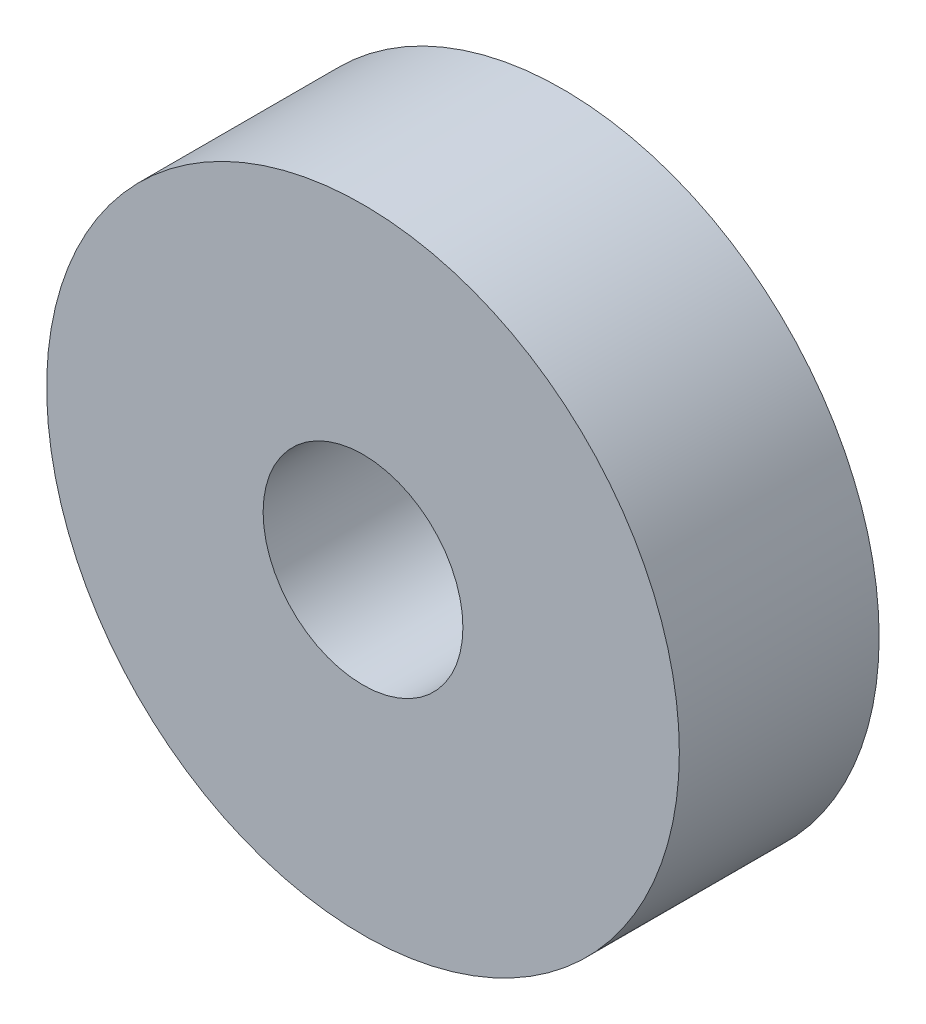
ISO-10303-21;
HEADER;
FILE_DESCRIPTION(('STEP AP214'),'2;1');
FILE_NAME('part.step','',(''),(''),'','','');
FILE_SCHEMA(('AUTOMOTIVE_DESIGN { 1 0 10303 214 1 1 1 1 }'));
ENDSEC;
DATA;
#1=APPLICATION_CONTEXT('core data for automotive mechanical design processes');
#2=APPLICATION_PROTOCOL_DEFINITION('international standard','automotive_design',2000,#1);
#3=PRODUCT_CONTEXT('',#1,'mechanical');
#4=PRODUCT('Part','Part','',(#3));
#5=PRODUCT_RELATED_PRODUCT_CATEGORY('part','',(#4));
#6=PRODUCT_DEFINITION_FORMATION('','',#4);
#7=PRODUCT_DEFINITION_CONTEXT('part definition',#1,'design');
#8=PRODUCT_DEFINITION('design','',#6,#7);
#9=PRODUCT_DEFINITION_SHAPE('','',#8);
#10=(LENGTH_UNIT() NAMED_UNIT(*) SI_UNIT(.MILLI.,.METRE.));
#11=(NAMED_UNIT(*) PLANE_ANGLE_UNIT() SI_UNIT($,.RADIAN.));
#12=(NAMED_UNIT(*) SI_UNIT($,.STERADIAN.) SOLID_ANGLE_UNIT());
#13=UNCERTAINTY_MEASURE_WITH_UNIT(LENGTH_MEASURE(1.E-05),#10,'distance_accuracy_value','');
#14=(GEOMETRIC_REPRESENTATION_CONTEXT(3) GLOBAL_UNCERTAINTY_ASSIGNED_CONTEXT((#13)) GLOBAL_UNIT_ASSIGNED_CONTEXT((#10,
#11,#12)) REPRESENTATION_CONTEXT('',''));
#15=CARTESIAN_POINT('',(0.,0.,0.));
#16=DIRECTION('',(0.,0.,1.));
#17=DIRECTION('',(1.,0.,0.));
#18=AXIS2_PLACEMENT_3D('',#15,#16,#17);
#19=CARTESIAN_POINT('',(0.,0.,6.));
#20=DIRECTION('',(0.,0.,1.));
#21=DIRECTION('',(1.,0.,0.));
#22=AXIS2_PLACEMENT_3D('',#19,#20,#21);
#23=PLANE('',#22);
#24=CARTESIAN_POINT('',(0.,0.,6.));
#25=DIRECTION('',(0.,0.,1.));
#26=DIRECTION('',(1.,0.,0.));
#27=AXIS2_PLACEMENT_3D('',#24,#25,#26);
#28=CIRCLE('',#27,9.5);
#29=CARTESIAN_POINT('',(9.5,0.,6.));
#30=VERTEX_POINT('',#29);
#31=EDGE_CURVE('E10',#30,#30,#28,.T.);
#32=ORIENTED_EDGE('',*,*,#31,.T.);
#33=EDGE_LOOP('',(#32));
#34=FACE_BOUND('',#33,.T.);
#35=CARTESIAN_POINT('',(0.,0.,6.));
#36=DIRECTION('',(0.,0.,1.));
#37=DIRECTION('',(1.,0.,0.));
#38=AXIS2_PLACEMENT_3D('',#35,#36,#37);
#39=CIRCLE('',#38,3.);
#40=CARTESIAN_POINT('',(3.,0.,6.));
#41=VERTEX_POINT('',#40);
#42=EDGE_CURVE('E40',#41,#41,#39,.T.);
#43=ORIENTED_EDGE('',*,*,#42,.F.);
#44=EDGE_LOOP('',(#43));
#45=FACE_BOUND('',#44,.T.);
#46=ADVANCED_FACE('F29',(#34,#45),#23,.T.);
#47=CARTESIAN_POINT('',(0.,0.,0.));
#48=DIRECTION('',(0.,0.,1.));
#49=DIRECTION('',(1.,0.,0.));
#50=AXIS2_PLACEMENT_3D('',#47,#48,#49);
#51=PLANE('',#50);
#52=CARTESIAN_POINT('',(0.,0.,0.));
#53=DIRECTION('',(0.,0.,1.));
#54=DIRECTION('',(1.,0.,0.));
#55=AXIS2_PLACEMENT_3D('',#52,#53,#54);
#56=CIRCLE('',#55,9.5);
#57=CARTESIAN_POINT('',(9.5,0.,0.));
#58=VERTEX_POINT('',#57);
#59=EDGE_CURVE('E33',#58,#58,#56,.T.);
#60=ORIENTED_EDGE('',*,*,#59,.F.);
#61=EDGE_LOOP('',(#60));
#62=FACE_BOUND('',#61,.T.);
#63=CARTESIAN_POINT('',(0.,0.,0.));
#64=DIRECTION('',(0.,0.,1.));
#65=DIRECTION('',(1.,0.,0.));
#66=AXIS2_PLACEMENT_3D('',#63,#64,#65);
#67=CIRCLE('',#66,3.);
#68=CARTESIAN_POINT('',(3.,0.,0.));
#69=VERTEX_POINT('',#68);
#70=EDGE_CURVE('E42',#69,#69,#67,.T.);
#71=ORIENTED_EDGE('',*,*,#70,.T.);
#72=EDGE_LOOP('',(#71));
#73=FACE_BOUND('',#72,.T.);
#74=ADVANCED_FACE('F52',(#62,#73),#51,.F.);
#75=CARTESIAN_POINT('',(0.,0.,6.));
#76=DIRECTION('',(0.,0.,-1.));
#77=DIRECTION('',(-1.,0.,0.));
#78=AXIS2_PLACEMENT_3D('',#75,#76,#77);
#79=CYLINDRICAL_SURFACE('',#78,9.5);
#80=ORIENTED_EDGE('',*,*,#31,.F.);
#81=EDGE_LOOP('',(#80));
#82=FACE_BOUND('',#81,.T.);
#83=ORIENTED_EDGE('',*,*,#59,.T.);
#84=EDGE_LOOP('',(#83));
#85=FACE_BOUND('',#84,.T.);
#86=ADVANCED_FACE('F31',(#82,#85),#79,.T.);
#87=CARTESIAN_POINT('',(0.,0.,6.));
#88=DIRECTION('',(0.,0.,-1.));
#89=DIRECTION('',(-1.,0.,0.));
#90=AXIS2_PLACEMENT_3D('',#87,#88,#89);
#91=CYLINDRICAL_SURFACE('',#90,3.);
#92=ORIENTED_EDGE('',*,*,#42,.T.);
#93=EDGE_LOOP('',(#92));
#94=FACE_BOUND('',#93,.T.);
#95=ORIENTED_EDGE('',*,*,#70,.F.);
#96=EDGE_LOOP('',(#95));
#97=FACE_BOUND('',#96,.T.);
#98=ADVANCED_FACE('F48',(#94,#97),#91,.F.);
#99=CLOSED_SHELL('',(#46,#74,#86,#98));
#100=MANIFOLD_SOLID_BREP('B2',#99);
#101=ADVANCED_BREP_SHAPE_REPRESENTATION('',(#18,#100),#14);
#102=SHAPE_DEFINITION_REPRESENTATION(#9,#101);
ENDSEC;
END-ISO-10303-21;
